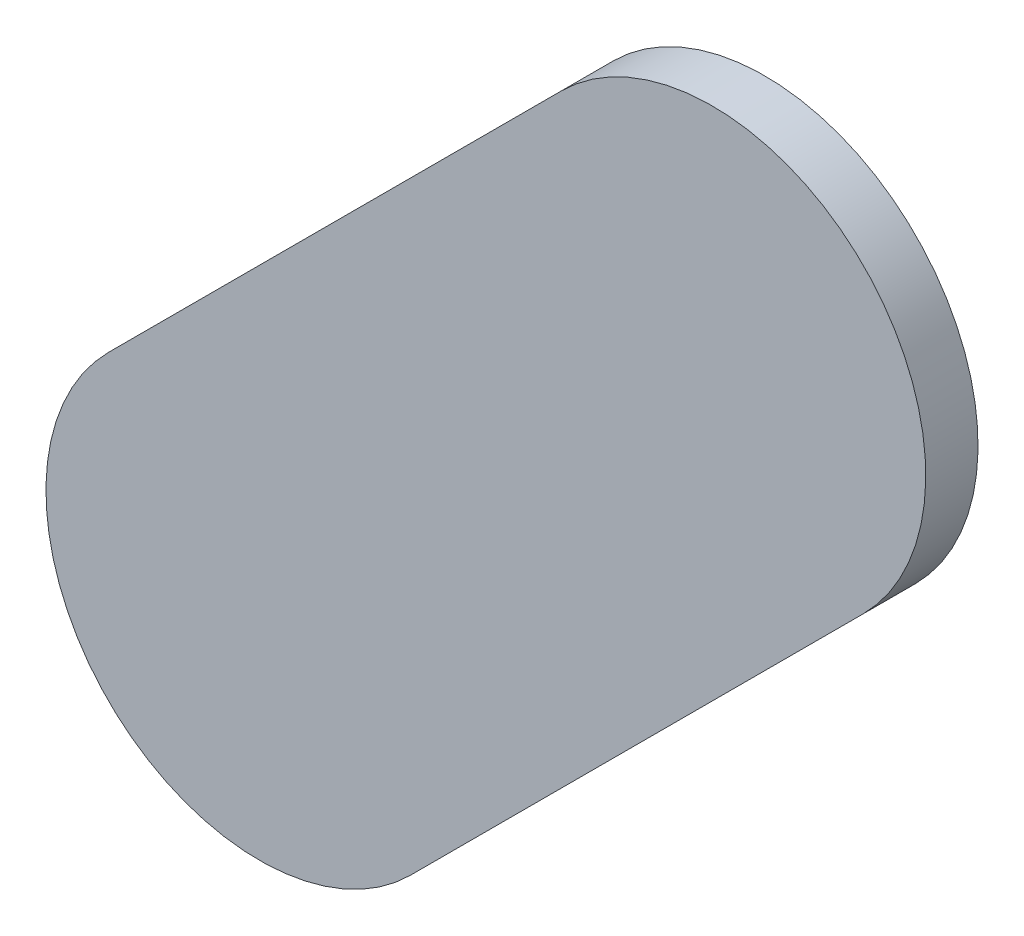
ISO-10303-21;
HEADER;
FILE_DESCRIPTION(('STEP AP214'),'2;1');
FILE_NAME('part.step','',(''),(''),'','','');
FILE_SCHEMA(('AUTOMOTIVE_DESIGN { 1 0 10303 214 1 1 1 1 }'));
ENDSEC;
DATA;
#1=APPLICATION_CONTEXT('core data for automotive mechanical design processes');
#2=APPLICATION_PROTOCOL_DEFINITION('international standard','automotive_design',2000,#1);
#3=PRODUCT_CONTEXT('',#1,'mechanical');
#4=PRODUCT('Part','Part','',(#3));
#5=PRODUCT_RELATED_PRODUCT_CATEGORY('part','',(#4));
#6=PRODUCT_DEFINITION_FORMATION('','',#4);
#7=PRODUCT_DEFINITION_CONTEXT('part definition',#1,'design');
#8=PRODUCT_DEFINITION('design','',#6,#7);
#9=PRODUCT_DEFINITION_SHAPE('','',#8);
#10=(LENGTH_UNIT() NAMED_UNIT(*) SI_UNIT(.MILLI.,.METRE.));
#11=(NAMED_UNIT(*) PLANE_ANGLE_UNIT() SI_UNIT($,.RADIAN.));
#12=(NAMED_UNIT(*) SI_UNIT($,.STERADIAN.) SOLID_ANGLE_UNIT());
#13=UNCERTAINTY_MEASURE_WITH_UNIT(LENGTH_MEASURE(1.E-05),#10,'distance_accuracy_value','');
#14=(GEOMETRIC_REPRESENTATION_CONTEXT(3) GLOBAL_UNCERTAINTY_ASSIGNED_CONTEXT((#13)) GLOBAL_UNIT_ASSIGNED_CONTEXT((#10,
#11,#12)) REPRESENTATION_CONTEXT('',''));
#15=CARTESIAN_POINT('',(0.,0.,0.));
#16=DIRECTION('',(0.,0.,1.));
#17=DIRECTION('',(1.,0.,0.));
#18=AXIS2_PLACEMENT_3D('',#15,#16,#17);
#19=CARTESIAN_POINT('',(6.48375142298,7.324411978031,0.79916));
#20=DIRECTION('',(0.,0.,1.));
#21=DIRECTION('',(1.,0.,0.));
#22=AXIS2_PLACEMENT_3D('',#19,#20,#21);
#23=PLANE('',#22);
#24=CARTESIAN_POINT('',(6.335258667,7.175919333,0.79916));
#25=DIRECTION('',(0.,0.,1.));
#26=DIRECTION('',(1.,0.,0.));
#27=AXIS2_PLACEMENT_3D('',#24,#25,#26);
#28=CIRCLE('',#27,0.139999667);
#29=CARTESIAN_POINT('',(6.43425398312217,7.07692465012202,0.79916));
#30=VERTEX_POINT('',#29);
#31=CARTESIAN_POINT('',(6.23626407216728,7.27491416596486,0.79916));
#32=VERTEX_POINT('',#31);
#33=EDGE_CURVE('E20',#30,#32,#28,.F.);
#34=ORIENTED_EDGE('',*,*,#33,.F.);
#35=DIRECTION('',(-0.707106660628037,-0.707106901745037,0.));
#36=VECTOR('',#35,1.);
#37=CARTESIAN_POINT('',(6.731238615866,7.373909384135,0.79916));
#38=LINE('',#37,#36);
#39=CARTESIAN_POINT('',(6.73123879105482,7.37390955932388,0.79916));
#40=VERTEX_POINT('',#39);
#41=EDGE_CURVE('E65',#30,#40,#38,.F.);
#42=ORIENTED_EDGE('',*,*,#41,.T.);
#43=CARTESIAN_POINT('',(6.632243667,7.472904434268,0.79916));
#44=DIRECTION('',(0.,0.,1.));
#45=DIRECTION('',(1.,0.,0.));
#46=AXIS2_PLACEMENT_3D('',#43,#44,#45);
#47=CIRCLE('',#46,0.14);
#48=CARTESIAN_POINT('',(6.53324864463338,7.57189931063353,0.79916));
#49=VERTEX_POINT('',#48);
#50=EDGE_CURVE('E57',#49,#40,#47,.F.);
#51=ORIENTED_EDGE('',*,*,#50,.F.);
#52=DIRECTION('',(0.707106099992719,0.707107462379719,0.));
#53=VECTOR('',#52,1.);
#54=CARTESIAN_POINT('',(6.2362642866,7.274914380398,0.79916));
#55=LINE('',#54,#53);
#56=EDGE_CURVE('E64',#49,#32,#55,.F.);
#57=ORIENTED_EDGE('',*,*,#56,.T.);
#58=EDGE_LOOP('',(#34,#42,#51,#57));
#59=FACE_BOUND('',#58,.T.);
#60=ADVANCED_FACE('F17',(#59),#23,.T.);
#61=CARTESIAN_POINT('',(6.731238615866,7.373909384135,0.76487));
#62=DIRECTION('',(-0.707106901745037,0.707106660628037,0.));
#63=DIRECTION('',(-0.707106660628037,-0.707106901745037,0.));
#64=AXIS2_PLACEMENT_3D('',#61,#62,#63);
#65=PLANE('',#64);
#66=DIRECTION('',(0.,0.,1.));
#67=VECTOR('',#66,1.);
#68=CARTESIAN_POINT('',(6.4342540000001,7.0769246669999,0.76487));
#69=LINE('',#68,#67);
#70=CARTESIAN_POINT('',(6.43425398312214,7.07692465012203,0.76487));
#71=VERTEX_POINT('',#70);
#72=EDGE_CURVE('E68',#71,#30,#69,.T.);
#73=ORIENTED_EDGE('',*,*,#72,.F.);
#74=DIRECTION('',(-0.707106660628131,-0.707106901744943,0.));
#75=VECTOR('',#74,1.);
#76=CARTESIAN_POINT('',(6.731238615866,7.373909384135,0.76487));
#77=LINE('',#76,#75);
#78=CARTESIAN_POINT('',(6.73123879105481,7.37390955932387,0.76487));
#79=VERTEX_POINT('',#78);
#80=EDGE_CURVE('E72',#79,#71,#77,.T.);
#81=ORIENTED_EDGE('',*,*,#80,.F.);
#82=DIRECTION('',(0.,0.,1.));
#83=VECTOR('',#82,1.);
#84=CARTESIAN_POINT('',(6.731238615866,7.373909384135,0.76487));
#85=LINE('',#84,#83);
#86=EDGE_CURVE('E60',#40,#79,#85,.F.);
#87=ORIENTED_EDGE('',*,*,#86,.F.);
#88=ORIENTED_EDGE('',*,*,#41,.F.);
#89=EDGE_LOOP('',(#73,#81,#87,#88));
#90=FACE_BOUND('',#89,.T.);
#91=ADVANCED_FACE('F70',(#90),#65,.F.);
#92=CARTESIAN_POINT('',(6.335258667,7.175919333,0.76487));
#93=DIRECTION('',(0.,0.,1.));
#94=DIRECTION('',(1.,0.,0.));
#95=AXIS2_PLACEMENT_3D('',#92,#93,#94);
#96=CYLINDRICAL_SURFACE('',#95,0.139999667);
#97=DIRECTION('',(0.,0.,1.));
#98=VECTOR('',#97,1.);
#99=CARTESIAN_POINT('',(6.2362642866,7.274914380398,0.76487));
#100=LINE('',#99,#98);
#101=CARTESIAN_POINT('',(6.23626407216729,7.27491416596488,0.76487));
#102=VERTEX_POINT('',#101);
#103=EDGE_CURVE('E77',#32,#102,#100,.F.);
#104=ORIENTED_EDGE('',*,*,#103,.T.);
#105=CARTESIAN_POINT('',(6.335259,7.175919565732,0.76487));
#106=DIRECTION('',(0.,0.,1.));
#107=DIRECTION('',(1.,0.,0.));
#108=AXIS2_PLACEMENT_3D('',#105,#106,#107);
#109=CIRCLE('',#108,0.14);
#110=EDGE_CURVE('E26',#71,#102,#109,.F.);
#111=ORIENTED_EDGE('',*,*,#110,.F.);
#112=ORIENTED_EDGE('',*,*,#72,.T.);
#113=ORIENTED_EDGE('',*,*,#33,.T.);
#114=EDGE_LOOP('',(#104,#111,#112,#113));
#115=FACE_BOUND('',#114,.T.);
#116=ADVANCED_FACE('F88',(#115),#96,.T.);
#117=CARTESIAN_POINT('',(6.2362642866,7.274914380398,0.76487));
#118=DIRECTION('',(0.707107462379719,-0.707106099992719,0.));
#119=DIRECTION('',(0.707106099992719,0.707107462379719,0.));
#120=AXIS2_PLACEMENT_3D('',#117,#118,#119);
#121=PLANE('',#120);
#122=DIRECTION('',(0.,0.,1.));
#123=VECTOR('',#122,1.);
#124=CARTESIAN_POINT('',(6.5332486669999,7.5718993330001,0.76487));
#125=LINE('',#124,#123);
#126=CARTESIAN_POINT('',(6.53324864463344,7.5718993106335,0.76487));
#127=VERTEX_POINT('',#126);
#128=EDGE_CURVE('E62',#127,#49,#125,.T.);
#129=ORIENTED_EDGE('',*,*,#128,.F.);
#130=DIRECTION('',(0.707106099992945,0.707107462379493,0.));
#131=VECTOR('',#130,1.);
#132=CARTESIAN_POINT('',(6.2362642866,7.274914380398,0.76487));
#133=LINE('',#132,#131);
#134=EDGE_CURVE('E11',#102,#127,#133,.T.);
#135=ORIENTED_EDGE('',*,*,#134,.F.);
#136=ORIENTED_EDGE('',*,*,#103,.F.);
#137=ORIENTED_EDGE('',*,*,#56,.F.);
#138=EDGE_LOOP('',(#129,#135,#136,#137));
#139=FACE_BOUND('',#138,.T.);
#140=ADVANCED_FACE('F96',(#139),#121,.F.);
#141=CARTESIAN_POINT('',(6.632243667,7.472904434268,0.76487));
#142=DIRECTION('',(0.,0.,1.));
#143=DIRECTION('',(1.,0.,0.));
#144=AXIS2_PLACEMENT_3D('',#141,#142,#143);
#145=CYLINDRICAL_SURFACE('',#144,0.14);
#146=CARTESIAN_POINT('',(6.632244,7.472904667,0.76487));
#147=DIRECTION('',(0.,0.,1.));
#148=DIRECTION('',(1.,0.,0.));
#149=AXIS2_PLACEMENT_3D('',#146,#147,#148);
#150=CIRCLE('',#149,0.14);
#151=EDGE_CURVE('E35',#127,#79,#150,.F.);
#152=ORIENTED_EDGE('',*,*,#151,.F.);
#153=ORIENTED_EDGE('',*,*,#128,.T.);
#154=ORIENTED_EDGE('',*,*,#50,.T.);
#155=ORIENTED_EDGE('',*,*,#86,.T.);
#156=EDGE_LOOP('',(#152,#153,#154,#155));
#157=FACE_BOUND('',#156,.T.);
#158=ADVANCED_FACE('F58',(#157),#145,.T.);
#159=CARTESIAN_POINT('',(6.48375142298,7.324411978031,0.76487));
#160=DIRECTION('',(0.,0.,-1.));
#161=DIRECTION('',(-1.,0.,0.));
#162=AXIS2_PLACEMENT_3D('',#159,#160,#161);
#163=PLANE('',#162);
#164=ORIENTED_EDGE('',*,*,#134,.T.);
#165=ORIENTED_EDGE('',*,*,#151,.T.);
#166=ORIENTED_EDGE('',*,*,#80,.T.);
#167=ORIENTED_EDGE('',*,*,#110,.T.);
#168=EDGE_LOOP('',(#164,#165,#166,#167));
#169=FACE_BOUND('',#168,.T.);
#170=ADVANCED_FACE('F89',(#169),#163,.T.);
#171=CLOSED_SHELL('',(#60,#91,#116,#140,#158,#170));
#172=MANIFOLD_SOLID_BREP('B1',#171);
#173=ADVANCED_BREP_SHAPE_REPRESENTATION('',(#18,#172),#14);
#174=SHAPE_DEFINITION_REPRESENTATION(#9,#173);
ENDSEC;
END-ISO-10303-21;
